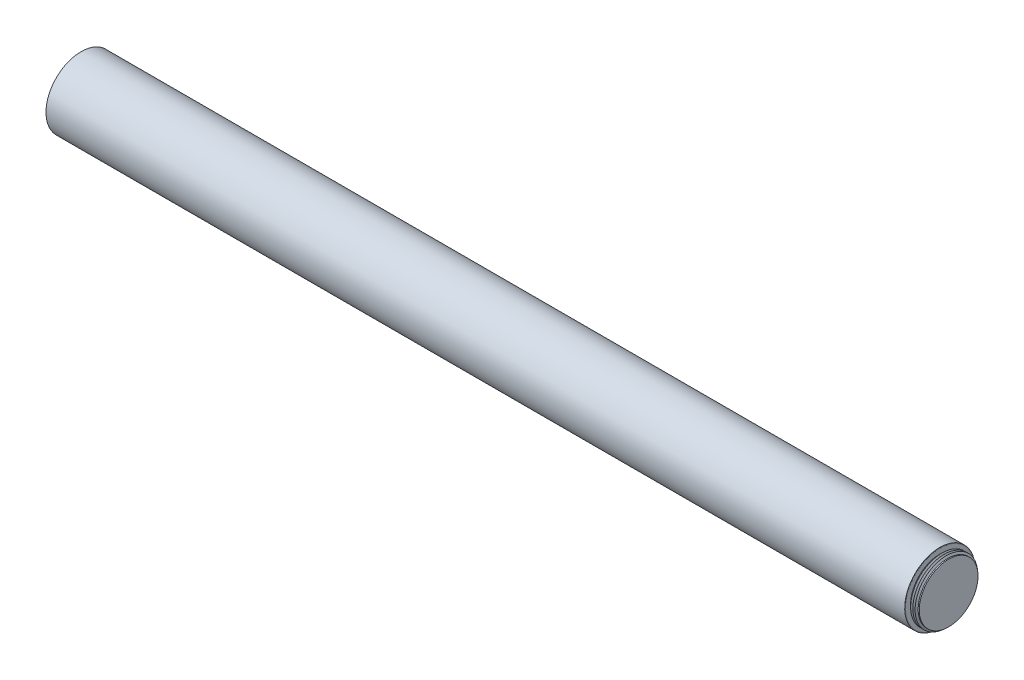
ISO-10303-21;
HEADER;
FILE_DESCRIPTION(('STEP AP214'),'2;1');
FILE_NAME('part.step','',(''),(''),'','','');
FILE_SCHEMA(('AUTOMOTIVE_DESIGN { 1 0 10303 214 1 1 1 1 }'));
ENDSEC;
DATA;
#1=APPLICATION_CONTEXT('core data for automotive mechanical design processes');
#2=APPLICATION_PROTOCOL_DEFINITION('international standard','automotive_design',2000,#1);
#3=PRODUCT_CONTEXT('',#1,'mechanical');
#4=PRODUCT('Part','Part','',(#3));
#5=PRODUCT_RELATED_PRODUCT_CATEGORY('part','',(#4));
#6=PRODUCT_DEFINITION_FORMATION('','',#4);
#7=PRODUCT_DEFINITION_CONTEXT('part definition',#1,'design');
#8=PRODUCT_DEFINITION('design','',#6,#7);
#9=PRODUCT_DEFINITION_SHAPE('','',#8);
#10=(LENGTH_UNIT() NAMED_UNIT(*) SI_UNIT(.MILLI.,.METRE.));
#11=(NAMED_UNIT(*) PLANE_ANGLE_UNIT() SI_UNIT($,.RADIAN.));
#12=(NAMED_UNIT(*) SI_UNIT($,.STERADIAN.) SOLID_ANGLE_UNIT());
#13=UNCERTAINTY_MEASURE_WITH_UNIT(LENGTH_MEASURE(1.E-05),#10,'distance_accuracy_value','');
#14=(GEOMETRIC_REPRESENTATION_CONTEXT(3) GLOBAL_UNCERTAINTY_ASSIGNED_CONTEXT((#13)) GLOBAL_UNIT_ASSIGNED_CONTEXT((#10,
#11,#12)) REPRESENTATION_CONTEXT('',''));
#15=CARTESIAN_POINT('',(0.,0.,0.));
#16=DIRECTION('',(0.,0.,1.));
#17=DIRECTION('',(1.,0.,0.));
#18=AXIS2_PLACEMENT_3D('',#15,#16,#17);
#19=CARTESIAN_POINT('',(-101.282037882412,-112.40761589404,6.95959679333066E-13));
#20=DIRECTION('',(1.,0.,0.));
#21=DIRECTION('',(0.,0.203317589338989,0.979112842253324));
#22=AXIS2_PLACEMENT_3D('',#19,#20,#21);
#23=PLANE('',#22);
#24=CARTESIAN_POINT('',(-101.282037882412,-112.40761589404,6.95959679333066E-13));
#25=DIRECTION('',(1.,0.,0.));
#26=DIRECTION('',(0.,0.203317589338989,0.979112842253324));
#27=AXIS2_PLACEMENT_3D('',#24,#25,#26);
#28=CIRCLE('',#27,49.784);
#29=CARTESIAN_POINT('',(-101.282037882411,-102.285653026388,48.7441537387402));
#30=VERTEX_POINT('',#29);
#31=EDGE_CURVE('E67',#30,#30,#28,.T.);
#32=ORIENTED_EDGE('',*,*,#31,.T.);
#33=EDGE_LOOP('',(#32));
#34=FACE_BOUND('',#33,.T.);
#35=CARTESIAN_POINT('',(-101.282037882412,-112.40761589404,8.14057642514373E-13));
#36=DIRECTION('',(1.,0.,0.));
#37=DIRECTION('',(0.,0.,-1.));
#38=AXIS2_PLACEMENT_3D('',#35,#36,#37);
#39=CIRCLE('',#38,48.8237923991093);
#40=CARTESIAN_POINT('',(-101.282037882412,-112.40761589404,-48.8237923991085));
#41=VERTEX_POINT('',#40);
#42=EDGE_CURVE('E18',#41,#41,#39,.T.);
#43=ORIENTED_EDGE('',*,*,#42,.F.);
#44=EDGE_LOOP('',(#43));
#45=FACE_BOUND('',#44,.T.);
#46=ADVANCED_FACE('F14',(#34,#45),#23,.T.);
#47=CARTESIAN_POINT('',(-1320.73603788241,-112.40761589404,1.97906001602816E-12));
#48=DIRECTION('',(1.,0.,0.));
#49=DIRECTION('',(0.,0.203317589338989,0.979112842253324));
#50=AXIS2_PLACEMENT_3D('',#47,#48,#49);
#51=PLANE('',#50);
#52=CARTESIAN_POINT('',(-1320.73603788241,-112.40761589404,1.97906001602816E-12));
#53=DIRECTION('',(1.,0.,0.));
#54=DIRECTION('',(0.,0.203317589338989,0.979112842253324));
#55=AXIS2_PLACEMENT_3D('',#52,#53,#54);
#56=CIRCLE('',#55,49.784);
#57=CARTESIAN_POINT('',(-1320.73603788241,-102.285653026388,48.7441537387414));
#58=VERTEX_POINT('',#57);
#59=EDGE_CURVE('E68',#58,#58,#56,.T.);
#60=ORIENTED_EDGE('',*,*,#59,.F.);
#61=EDGE_LOOP('',(#60));
#62=FACE_BOUND('',#61,.T.);
#63=CARTESIAN_POINT('',(-1320.73603788241,-112.40761589404,1.98736084132082E-12));
#64=DIRECTION('',(1.,0.,0.));
#65=DIRECTION('',(0.,0.,-1.));
#66=AXIS2_PLACEMENT_3D('',#63,#64,#65);
#67=CIRCLE('',#66,48.9203999999995);
#68=CARTESIAN_POINT('',(-1320.73603788241,-112.40761589404,-48.9203999999975));
#69=VERTEX_POINT('',#68);
#70=EDGE_CURVE('E64',#69,#69,#67,.F.);
#71=ORIENTED_EDGE('',*,*,#70,.F.);
#72=EDGE_LOOP('',(#71));
#73=FACE_BOUND('',#72,.T.);
#74=ADVANCED_FACE('F276',(#62,#73),#51,.F.);
#75=CARTESIAN_POINT('',(-101.282037882412,-112.40761589404,6.95959679333066E-13));
#76=DIRECTION('',(-1.,0.,0.));
#77=DIRECTION('',(0.,-0.203317589338989,-0.979112842253324));
#78=AXIS2_PLACEMENT_3D('',#75,#76,#77);
#79=CYLINDRICAL_SURFACE('',#78,49.784);
#80=ORIENTED_EDGE('',*,*,#31,.F.);
#81=EDGE_LOOP('',(#80));
#82=FACE_BOUND('',#81,.T.);
#83=ORIENTED_EDGE('',*,*,#59,.T.);
#84=EDGE_LOOP('',(#83));
#85=FACE_BOUND('',#84,.T.);
#86=ADVANCED_FACE('F283',(#82,#85),#79,.T.);
#87=CARTESIAN_POINT('',(-1320.73603788241,-112.40761589404,1.98045789837065E-12));
#88=DIRECTION('',(1.,0.,0.));
#89=DIRECTION('',(0.,0.999990910254518,-0.00426373173999859));
#90=AXIS2_PLACEMENT_3D('',#87,#88,#89);
#91=CIRCLE('',#90,44.45);
#92=CARTESIAN_POINT('',(-1320.73603788241,-67.9580199332265,-0.189522875840957));
#93=VERTEX_POINT('',#92);
#94=EDGE_CURVE('E155',#93,#93,#91,.T.);
#95=ORIENTED_EDGE('',*,*,#94,.T.);
#96=EDGE_LOOP('',(#95));
#97=FACE_BOUND('',#96,.T.);
#98=ORIENTED_EDGE('',*,*,#70,.T.);
#99=EDGE_LOOP('',(#98));
#100=FACE_BOUND('',#99,.T.);
#101=ADVANCED_FACE('F163',(#97,#100),#51,.F.);
#102=CARTESIAN_POINT('',(-101.114708609272,-112.40761589404,7.84938641112028E-13));
#103=DIRECTION('',(1.,0.,0.));
#104=DIRECTION('',(0.,0.,-1.));
#105=AXIS2_PLACEMENT_3D('',#102,#103,#104);
#106=CONICAL_SURFACE('',#105,48.9204,0.523598775598301);
#107=ORIENTED_EDGE('',*,*,#42,.T.);
#108=EDGE_LOOP('',(#107));
#109=FACE_BOUND('',#108,.T.);
#110=CARTESIAN_POINT('',(-101.114708609272,-112.40761589404,7.84938641112028E-13));
#111=DIRECTION('',(-1.,0.,0.));
#112=DIRECTION('',(0.,0.,1.));
#113=AXIS2_PLACEMENT_3D('',#110,#111,#112);
#114=CIRCLE('',#113,48.9204);
#115=CARTESIAN_POINT('',(-101.114708609272,-112.40761589404,48.9204000000008));
#116=VERTEX_POINT('',#115);
#117=EDGE_CURVE('E10',#116,#116,#114,.T.);
#118=ORIENTED_EDGE('',*,*,#117,.T.);
#119=EDGE_LOOP('',(#118));
#120=FACE_BOUND('',#119,.T.);
#121=ADVANCED_FACE('F16',(#109,#120),#106,.T.);
#122=CARTESIAN_POINT('',(-101.114708609272,-63.4872158940397,7.84938641112028E-13));
#123=DIRECTION('',(-1.,0.,0.));
#124=DIRECTION('',(0.,0.,1.));
#125=AXIS2_PLACEMENT_3D('',#122,#123,#124);
#126=PLANE('',#125);
#127=ORIENTED_EDGE('',*,*,#117,.F.);
#128=EDGE_LOOP('',(#127));
#129=FACE_BOUND('',#128,.T.);
#130=CARTESIAN_POINT('',(-101.114708609271,-112.40761589404,7.84938641112028E-13));
#131=DIRECTION('',(1.,0.,0.));
#132=DIRECTION('',(0.,0.,-1.));
#133=AXIS2_PLACEMENT_3D('',#130,#131,#132);
#134=CIRCLE('',#133,41.70035475);
#135=CARTESIAN_POINT('',(-101.114708609271,-112.40761589404,-41.7003547499992));
#136=VERTEX_POINT('',#135);
#137=EDGE_CURVE('E23',#136,#136,#134,.T.);
#138=ORIENTED_EDGE('',*,*,#137,.F.);
#139=EDGE_LOOP('',(#138));
#140=FACE_BOUND('',#139,.T.);
#141=ADVANCED_FACE('F329',(#129,#140),#126,.F.);
#142=CARTESIAN_POINT('',(-88.6687086092715,-67.9576158940398,7.84938641112028E-13));
#143=DIRECTION('',(-1.,0.,0.));
#144=DIRECTION('',(0.,0.,1.));
#145=AXIS2_PLACEMENT_3D('',#142,#143,#144);
#146=PLANE('',#145);
#147=CARTESIAN_POINT('',(-88.6687086092715,-112.40761589404,7.84938641112028E-13));
#148=DIRECTION('',(1.,0.,0.));
#149=DIRECTION('',(0.,0.,-1.));
#150=AXIS2_PLACEMENT_3D('',#147,#148,#149);
#151=CIRCLE('',#150,41.70035475);
#152=CARTESIAN_POINT('',(-88.6687086092715,-112.40761589404,-41.7003547499992));
#153=VERTEX_POINT('',#152);
#154=EDGE_CURVE('E60',#153,#153,#151,.T.);
#155=ORIENTED_EDGE('',*,*,#154,.T.);
#156=EDGE_LOOP('',(#155));
#157=FACE_BOUND('',#156,.T.);
#158=ADVANCED_FACE('F326',(#157),#146,.F.);
#159=CARTESIAN_POINT('',(-88.6687086092715,-112.40761589404,7.84938641112028E-13));
#160=DIRECTION('',(1.,0.,0.));
#161=DIRECTION('',(0.,0.,-1.));
#162=AXIS2_PLACEMENT_3D('',#159,#160,#161);
#163=CYLINDRICAL_SURFACE('',#162,41.70035475);
#164=CARTESIAN_POINT('',(-99.7812591608523,-112.40761589404,7.84938641112028E-13));
#165=DIRECTION('',(1.,0.,0.));
#166=DIRECTION('',(0.,0.,-1.));
#167=AXIS2_PLACEMENT_3D('',#164,#165,#166);
#168=CIRCLE('',#167,41.70035475);
#169=CARTESIAN_POINT('',(-99.7812591608523,-112.40761589404,-41.7003547499992));
#170=VERTEX_POINT('',#169);
#171=EDGE_CURVE('E30',#170,#170,#168,.T.);
#172=ORIENTED_EDGE('',*,*,#171,.F.);
#173=EDGE_LOOP('',(#172));
#174=FACE_BOUND('',#173,.T.);
#175=ORIENTED_EDGE('',*,*,#137,.T.);
#176=EDGE_LOOP('',(#175));
#177=FACE_BOUND('',#176,.T.);
#178=ADVANCED_FACE('F322',(#174,#177),#163,.T.);
#179=CARTESIAN_POINT('',(-99.7812591608523,-112.40761589404,7.84938641112028E-13));
#180=DIRECTION('',(1.,0.,0.));
#181=DIRECTION('',(0.,0.,-1.));
#182=AXIS2_PLACEMENT_3D('',#179,#180,#181);
#183=CONICAL_SURFACE('',#182,41.70035475,1.0471975511966);
#184=CARTESIAN_POINT('',(-98.1937507355888,-112.40761589404,7.84938641112028E-13));
#185=DIRECTION('',(1.,0.,0.));
#186=DIRECTION('',(0.,0.,-1.));
#187=AXIS2_PLACEMENT_3D('',#184,#185,#186);
#188=CIRCLE('',#187,44.45);
#189=CARTESIAN_POINT('',(-98.1937507355888,-112.40761589404,-44.4499999999992));
#190=VERTEX_POINT('',#189);
#191=EDGE_CURVE('E36',#190,#190,#188,.T.);
#192=ORIENTED_EDGE('',*,*,#191,.F.);
#193=EDGE_LOOP('',(#192));
#194=FACE_BOUND('',#193,.T.);
#195=ORIENTED_EDGE('',*,*,#171,.T.);
#196=EDGE_LOOP('',(#195));
#197=FACE_BOUND('',#196,.T.);
#198=ADVANCED_FACE('F318',(#194,#197),#183,.T.);
#199=CARTESIAN_POINT('',(-98.1937507355888,-112.40761589404,7.84938641112028E-13));
#200=DIRECTION('',(-1.,0.,0.));
#201=DIRECTION('',(0.,0.,1.));
#202=AXIS2_PLACEMENT_3D('',#199,#200,#201);
#203=CONICAL_SURFACE('',#202,44.45,1.0471975511966);
#204=CARTESIAN_POINT('',(-96.6062423103254,-112.40761589404,7.84938641112028E-13));
#205=DIRECTION('',(1.,0.,0.));
#206=DIRECTION('',(0.,0.,-1.));
#207=AXIS2_PLACEMENT_3D('',#204,#205,#206);
#208=CIRCLE('',#207,41.70035475);
#209=CARTESIAN_POINT('',(-96.6062423103254,-112.40761589404,-41.7003547499992));
#210=VERTEX_POINT('',#209);
#211=EDGE_CURVE('E40',#210,#210,#208,.T.);
#212=ORIENTED_EDGE('',*,*,#211,.F.);
#213=EDGE_LOOP('',(#212));
#214=FACE_BOUND('',#213,.T.);
#215=ORIENTED_EDGE('',*,*,#191,.T.);
#216=EDGE_LOOP('',(#215));
#217=FACE_BOUND('',#216,.T.);
#218=ADVANCED_FACE('F314',(#214,#217),#203,.T.);
#219=CARTESIAN_POINT('',(-96.6062423103254,-112.40761589404,7.84938641112028E-13));
#220=DIRECTION('',(1.,0.,0.));
#221=DIRECTION('',(0.,0.,-1.));
#222=AXIS2_PLACEMENT_3D('',#219,#220,#221);
#223=CONICAL_SURFACE('',#222,41.70035475,1.0471975511966);
#224=CARTESIAN_POINT('',(-95.0187338850619,-112.40761589404,7.84938641112028E-13));
#225=DIRECTION('',(1.,0.,0.));
#226=DIRECTION('',(0.,0.,-1.));
#227=AXIS2_PLACEMENT_3D('',#224,#225,#226);
#228=CIRCLE('',#227,44.45);
#229=CARTESIAN_POINT('',(-95.0187338850619,-112.40761589404,-44.4499999999992));
#230=VERTEX_POINT('',#229);
#231=EDGE_CURVE('E44',#230,#230,#228,.T.);
#232=ORIENTED_EDGE('',*,*,#231,.F.);
#233=EDGE_LOOP('',(#232));
#234=FACE_BOUND('',#233,.T.);
#235=ORIENTED_EDGE('',*,*,#211,.T.);
#236=EDGE_LOOP('',(#235));
#237=FACE_BOUND('',#236,.T.);
#238=ADVANCED_FACE('F310',(#234,#237),#223,.T.);
#239=CARTESIAN_POINT('',(-95.0187338850619,-112.40761589404,7.84938641112028E-13));
#240=DIRECTION('',(-1.,0.,0.));
#241=DIRECTION('',(0.,0.,1.));
#242=AXIS2_PLACEMENT_3D('',#239,#240,#241);
#243=CONICAL_SURFACE('',#242,44.45,1.0471975511966);
#244=CARTESIAN_POINT('',(-93.4312254597984,-112.40761589404,7.84938641112028E-13));
#245=DIRECTION('',(1.,0.,0.));
#246=DIRECTION('',(0.,0.,-1.));
#247=AXIS2_PLACEMENT_3D('',#244,#245,#246);
#248=CIRCLE('',#247,41.70035475);
#249=CARTESIAN_POINT('',(-93.4312254597984,-112.40761589404,-41.7003547499992));
#250=VERTEX_POINT('',#249);
#251=EDGE_CURVE('E48',#250,#250,#248,.T.);
#252=ORIENTED_EDGE('',*,*,#251,.F.);
#253=EDGE_LOOP('',(#252));
#254=FACE_BOUND('',#253,.T.);
#255=ORIENTED_EDGE('',*,*,#231,.T.);
#256=EDGE_LOOP('',(#255));
#257=FACE_BOUND('',#256,.T.);
#258=ADVANCED_FACE('F306',(#254,#257),#243,.T.);
#259=CARTESIAN_POINT('',(-93.4312254597984,-112.40761589404,7.84938641112028E-13));
#260=DIRECTION('',(1.,0.,0.));
#261=DIRECTION('',(0.,0.,-1.));
#262=AXIS2_PLACEMENT_3D('',#259,#260,#261);
#263=CONICAL_SURFACE('',#262,41.70035475,1.0471975511966);
#264=CARTESIAN_POINT('',(-91.843717034535,-112.40761589404,7.84938641112028E-13));
#265=DIRECTION('',(1.,0.,0.));
#266=DIRECTION('',(0.,0.,-1.));
#267=AXIS2_PLACEMENT_3D('',#264,#265,#266);
#268=CIRCLE('',#267,44.45);
#269=CARTESIAN_POINT('',(-91.843717034535,-112.40761589404,-44.4499999999992));
#270=VERTEX_POINT('',#269);
#271=EDGE_CURVE('E52',#270,#270,#268,.T.);
#272=ORIENTED_EDGE('',*,*,#271,.F.);
#273=EDGE_LOOP('',(#272));
#274=FACE_BOUND('',#273,.T.);
#275=ORIENTED_EDGE('',*,*,#251,.T.);
#276=EDGE_LOOP('',(#275));
#277=FACE_BOUND('',#276,.T.);
#278=ADVANCED_FACE('F302',(#274,#277),#263,.T.);
#279=CARTESIAN_POINT('',(-91.843717034535,-112.40761589404,7.84938641112028E-13));
#280=DIRECTION('',(-1.,0.,0.));
#281=DIRECTION('',(0.,0.,1.));
#282=AXIS2_PLACEMENT_3D('',#279,#280,#281);
#283=CONICAL_SURFACE('',#282,44.45,1.04719755119659);
#284=CARTESIAN_POINT('',(-90.2562086092715,-112.40761589404,7.84938641112028E-13));
#285=DIRECTION('',(1.,0.,0.));
#286=DIRECTION('',(0.,0.,-1.));
#287=AXIS2_PLACEMENT_3D('',#284,#285,#286);
#288=CIRCLE('',#287,41.70035475);
#289=CARTESIAN_POINT('',(-90.2562086092715,-112.40761589404,-41.7003547499992));
#290=VERTEX_POINT('',#289);
#291=EDGE_CURVE('E56',#290,#290,#288,.T.);
#292=ORIENTED_EDGE('',*,*,#291,.F.);
#293=EDGE_LOOP('',(#292));
#294=FACE_BOUND('',#293,.T.);
#295=ORIENTED_EDGE('',*,*,#271,.T.);
#296=EDGE_LOOP('',(#295));
#297=FACE_BOUND('',#296,.T.);
#298=ADVANCED_FACE('F298',(#294,#297),#283,.T.);
#299=CARTESIAN_POINT('',(-88.6687086092715,-112.40761589404,7.84938641112028E-13));
#300=DIRECTION('',(1.,0.,0.));
#301=DIRECTION('',(0.,0.,-1.));
#302=AXIS2_PLACEMENT_3D('',#299,#300,#301);
#303=CYLINDRICAL_SURFACE('',#302,41.70035475);
#304=ORIENTED_EDGE('',*,*,#154,.F.);
#305=EDGE_LOOP('',(#304));
#306=FACE_BOUND('',#305,.T.);
#307=ORIENTED_EDGE('',*,*,#291,.T.);
#308=EDGE_LOOP('',(#307));
#309=FACE_BOUND('',#308,.T.);
#310=ADVANCED_FACE('F295',(#306,#309),#303,.T.);
#311=CARTESIAN_POINT('',(-1276.03203788241,-112.40761589404,1.78264800939103E-12));
#312=DIRECTION('',(-1.,0.,0.));
#313=DIRECTION('',(0.,0.,1.));
#314=AXIS2_PLACEMENT_3D('',#311,#312,#313);
#315=PLANE('',#314);
#316=CARTESIAN_POINT('',(-1276.03203788241,-112.40761589404,1.78264800939103E-12));
#317=DIRECTION('',(-1.,0.,0.));
#318=DIRECTION('',(0.,-0.999990910254518,0.00426373173999859));
#319=AXIS2_PLACEMENT_3D('',#316,#317,#318);
#320=CIRCLE('',#319,36.449);
#321=CARTESIAN_POINT('',(-1276.03203788241,-148.856284581907,0.155408758192991));
#322=VERTEX_POINT('',#321);
#323=EDGE_CURVE('E151',#322,#322,#320,.T.);
#324=ORIENTED_EDGE('',*,*,#323,.T.);
#325=EDGE_LOOP('',(#324));
#326=FACE_BOUND('',#325,.T.);
#327=ADVANCED_FACE('F288',(#326),#315,.T.);
#328=CARTESIAN_POINT('',(-1277.55603788241,-112.40761589404,1.85339397344328E-12));
#329=DIRECTION('',(1.,0.,0.));
#330=DIRECTION('',(0.,0.999990910254518,-0.00426373173999859));
#331=AXIS2_PLACEMENT_3D('',#328,#329,#330);
#332=CONICAL_SURFACE('',#331,34.925,0.785398163397451);
#333=ORIENTED_EDGE('',*,*,#323,.F.);
#334=EDGE_LOOP('',(#333));
#335=FACE_BOUND('',#334,.T.);
#336=CARTESIAN_POINT('',(-1277.55603788241,-112.40761589404,1.85339397344328E-12));
#337=DIRECTION('',(-1.,0.,0.));
#338=DIRECTION('',(0.,-0.999990910254518,0.00426373173999859));
#339=AXIS2_PLACEMENT_3D('',#336,#337,#338);
#340=CIRCLE('',#339,34.925);
#341=CARTESIAN_POINT('',(-1277.55603788241,-147.332298434679,0.148910831021304));
#342=VERTEX_POINT('',#341);
#343=EDGE_CURVE('E143',#342,#342,#340,.F.);
#344=ORIENTED_EDGE('',*,*,#343,.F.);
#345=EDGE_LOOP('',(#344));
#346=FACE_BOUND('',#345,.T.);
#347=ADVANCED_FACE('F170',(#335,#346),#332,.F.);
#348=CARTESIAN_POINT('',(-1320.73603788241,-112.40761589404,1.98045789837065E-12));
#349=DIRECTION('',(1.,0.,0.));
#350=DIRECTION('',(0.,0.999990910254518,-0.00426373173999859));
#351=AXIS2_PLACEMENT_3D('',#348,#349,#350);
#352=CYLINDRICAL_SURFACE('',#351,44.45);
#353=ORIENTED_EDGE('',*,*,#94,.F.);
#354=EDGE_LOOP('',(#353));
#355=FACE_BOUND('',#354,.T.);
#356=CARTESIAN_POINT('',(-1318.95803788241,-112.40761589404,1.9787493151274E-12));
#357=DIRECTION('',(1.,0.,0.));
#358=DIRECTION('',(0.,0.999990910254518,-0.00426373173999859));
#359=AXIS2_PLACEMENT_3D('',#356,#357,#358);
#360=CIRCLE('',#359,44.45);
#361=CARTESIAN_POINT('',(-1318.95803788241,-67.9580199332265,-0.189522875840959));
#362=VERTEX_POINT('',#361);
#363=EDGE_CURVE('E72',#362,#362,#360,.T.);
#364=ORIENTED_EDGE('',*,*,#363,.T.);
#365=EDGE_LOOP('',(#364));
#366=FACE_BOUND('',#365,.T.);
#367=ADVANCED_FACE('F166',(#355,#366),#352,.F.);
#368=CARTESIAN_POINT('',(-1317.37052945715,-112.40761589404,1.97763423154013E-12));
#369=DIRECTION('',(-1.,0.,0.));
#370=DIRECTION('',(0.,-0.999990910254518,0.00426373173999859));
#371=AXIS2_PLACEMENT_3D('',#368,#369,#370);
#372=CONICAL_SURFACE('',#371,41.70035475,1.0471975511966);
#373=ORIENTED_EDGE('',*,*,#363,.F.);
#374=EDGE_LOOP('',(#373));
#375=FACE_BOUND('',#374,.T.);
#376=CARTESIAN_POINT('',(-1317.37052945715,-112.40761589404,1.97763423154013E-12));
#377=DIRECTION('',(1.,0.,0.));
#378=DIRECTION('',(0.,0.999990910254518,-0.00426373173999859));
#379=AXIS2_PLACEMENT_3D('',#376,#377,#378);
#380=CIRCLE('',#379,41.70035475);
#381=CARTESIAN_POINT('',(-1317.37052945715,-70.707640189651,-0.177799126114798));
#382=VERTEX_POINT('',#381);
#383=EDGE_CURVE('E79',#382,#382,#380,.T.);
#384=ORIENTED_EDGE('',*,*,#383,.T.);
#385=EDGE_LOOP('',(#384));
#386=FACE_BOUND('',#385,.T.);
#387=ADVANCED_FACE('F169',(#375,#386),#372,.F.);
#388=CARTESIAN_POINT('',(-1315.78302103189,-112.40761589404,1.97608547102591E-12));
#389=DIRECTION('',(1.,0.,0.));
#390=DIRECTION('',(0.,0.999990910254518,-0.00426373173999859));
#391=AXIS2_PLACEMENT_3D('',#388,#389,#390);
#392=CONICAL_SURFACE('',#391,44.45,1.04719755119659);
#393=ORIENTED_EDGE('',*,*,#383,.F.);
#394=EDGE_LOOP('',(#393));
#395=FACE_BOUND('',#394,.T.);
#396=CARTESIAN_POINT('',(-1315.78302103189,-112.40761589404,1.97608547102591E-12));
#397=DIRECTION('',(1.,0.,0.));
#398=DIRECTION('',(0.,0.999990910254518,-0.00426373173999859));
#399=AXIS2_PLACEMENT_3D('',#396,#397,#398);
#400=CIRCLE('',#399,44.45);
#401=CARTESIAN_POINT('',(-1315.78302103189,-67.9580199332265,-0.189522875840961));
#402=VERTEX_POINT('',#401);
#403=EDGE_CURVE('E83',#402,#402,#400,.T.);
#404=ORIENTED_EDGE('',*,*,#403,.T.);
#405=EDGE_LOOP('',(#404));
#406=FACE_BOUND('',#405,.T.);
#407=ADVANCED_FACE('F176',(#395,#406),#392,.F.);
#408=CARTESIAN_POINT('',(-1314.19551681924,-112.40761589404,1.97475355250955E-12));
#409=DIRECTION('',(-1.,0.,0.));
#410=DIRECTION('',(0.,-0.999990910254518,0.00426373173999859));
#411=AXIS2_PLACEMENT_3D('',#408,#409,#410);
#412=CONICAL_SURFACE('',#411,41.7003620464632,1.0471975511966);
#413=ORIENTED_EDGE('',*,*,#403,.F.);
#414=EDGE_LOOP('',(#413));
#415=FACE_BOUND('',#414,.T.);
#416=CARTESIAN_POINT('',(-1314.19551681924,-112.40761589404,1.97475355250955E-12));
#417=DIRECTION('',(1.,0.,0.));
#418=DIRECTION('',(0.,0.999990910254518,-0.00426373173999859));
#419=AXIS2_PLACEMENT_3D('',#416,#417,#418);
#420=CIRCLE('',#419,41.7003620464632);
#421=CARTESIAN_POINT('',(-1314.19551681924,-70.7076328932542,-0.177799157224963));
#422=VERTEX_POINT('',#421);
#423=EDGE_CURVE('E87',#422,#422,#420,.T.);
#424=ORIENTED_EDGE('',*,*,#423,.T.);
#425=EDGE_LOOP('',(#424));
#426=FACE_BOUND('',#425,.T.);
#427=ADVANCED_FACE('F182',(#415,#426),#412,.F.);
#428=CARTESIAN_POINT('',(-1312.60800839397,-112.40761589404,1.9734216304588E-12));
#429=DIRECTION('',(1.,0.,0.));
#430=DIRECTION('',(0.,0.999990910254518,-0.00426373173999859));
#431=AXIS2_PLACEMENT_3D('',#428,#429,#430);
#432=CONICAL_SURFACE('',#431,44.4500072964631,1.04719755119659);
#433=ORIENTED_EDGE('',*,*,#423,.F.);
#434=EDGE_LOOP('',(#433));
#435=FACE_BOUND('',#434,.T.);
#436=CARTESIAN_POINT('',(-1312.60800839397,-112.40761589404,1.9734216304588E-12));
#437=DIRECTION('',(1.,0.,0.));
#438=DIRECTION('',(0.,0.999990910254518,-0.00426373173999859));
#439=AXIS2_PLACEMENT_3D('',#436,#437,#438);
#440=CIRCLE('',#439,44.4500072964631);
#441=CARTESIAN_POINT('',(-1312.60800839397,-67.9580126368297,-0.189522906951126));
#442=VERTEX_POINT('',#441);
#443=EDGE_CURVE('E91',#442,#442,#440,.T.);
#444=ORIENTED_EDGE('',*,*,#443,.T.);
#445=EDGE_LOOP('',(#444));
#446=FACE_BOUND('',#445,.T.);
#447=ADVANCED_FACE('F188',(#435,#446),#432,.F.);
#448=CARTESIAN_POINT('',(-1311.02050418132,-112.40761589404,1.97208971194244E-12));
#449=DIRECTION('',(-1.,0.,0.));
#450=DIRECTION('',(0.,-0.999990910254518,0.00426373173999859));
#451=AXIS2_PLACEMENT_3D('',#448,#449,#450);
#452=CONICAL_SURFACE('',#451,41.7003693429263,1.0471975511966);
#453=ORIENTED_EDGE('',*,*,#443,.F.);
#454=EDGE_LOOP('',(#453));
#455=FACE_BOUND('',#454,.T.);
#456=CARTESIAN_POINT('',(-1311.02050418132,-112.40761589404,1.97208971194244E-12));
#457=DIRECTION('',(1.,0.,0.));
#458=DIRECTION('',(0.,0.999990910254518,-0.00426373173999859));
#459=AXIS2_PLACEMENT_3D('',#456,#457,#458);
#460=CIRCLE('',#459,41.7003693429263);
#461=CARTESIAN_POINT('',(-1311.02050418132,-70.7076255968573,-0.177799188335127));
#462=VERTEX_POINT('',#461);
#463=EDGE_CURVE('E95',#462,#462,#460,.T.);
#464=ORIENTED_EDGE('',*,*,#463,.T.);
#465=EDGE_LOOP('',(#464));
#466=FACE_BOUND('',#465,.T.);
#467=ADVANCED_FACE('F194',(#455,#466),#452,.F.);
#468=CARTESIAN_POINT('',(-1309.43299575606,-112.40761589404,1.9707577898917E-12));
#469=DIRECTION('',(1.,0.,0.));
#470=DIRECTION('',(0.,0.999990910254518,-0.00426373173999859));
#471=AXIS2_PLACEMENT_3D('',#468,#469,#470);
#472=CONICAL_SURFACE('',#471,44.4500145929263,1.04719755119659);
#473=ORIENTED_EDGE('',*,*,#463,.F.);
#474=EDGE_LOOP('',(#473));
#475=FACE_BOUND('',#474,.T.);
#476=CARTESIAN_POINT('',(-1309.43299575606,-112.40761589404,1.9707577898917E-12));
#477=DIRECTION('',(1.,0.,0.));
#478=DIRECTION('',(0.,0.999990910254518,-0.00426373173999859));
#479=AXIS2_PLACEMENT_3D('',#476,#477,#478);
#480=CIRCLE('',#479,44.4500145929263);
#481=CARTESIAN_POINT('',(-1309.43299575606,-67.9580053404328,-0.18952293806129));
#482=VERTEX_POINT('',#481);
#483=EDGE_CURVE('E99',#482,#482,#480,.T.);
#484=ORIENTED_EDGE('',*,*,#483,.T.);
#485=EDGE_LOOP('',(#484));
#486=FACE_BOUND('',#485,.T.);
#487=ADVANCED_FACE('F200',(#475,#486),#472,.F.);
#488=CARTESIAN_POINT('',(-1307.84549154341,-112.40761589404,1.96942587137534E-12));
#489=DIRECTION('',(-1.,0.,0.));
#490=DIRECTION('',(0.,-0.999990910254518,0.00426373173999859));
#491=AXIS2_PLACEMENT_3D('',#488,#489,#490);
#492=CONICAL_SURFACE('',#491,41.7003766393895,1.0471975511966);
#493=ORIENTED_EDGE('',*,*,#483,.F.);
#494=EDGE_LOOP('',(#493));
#495=FACE_BOUND('',#494,.T.);
#496=CARTESIAN_POINT('',(-1307.84549154341,-112.40761589404,1.96942587137534E-12));
#497=DIRECTION('',(1.,0.,0.));
#498=DIRECTION('',(0.,0.999990910254518,-0.00426373173999859));
#499=AXIS2_PLACEMENT_3D('',#496,#497,#498);
#500=CIRCLE('',#499,41.7003766393895);
#501=CARTESIAN_POINT('',(-1307.84549154341,-70.7076183004605,-0.177799219445291));
#502=VERTEX_POINT('',#501);
#503=EDGE_CURVE('E103',#502,#502,#500,.T.);
#504=ORIENTED_EDGE('',*,*,#503,.T.);
#505=EDGE_LOOP('',(#504));
#506=FACE_BOUND('',#505,.T.);
#507=ADVANCED_FACE('F206',(#495,#506),#492,.F.);
#508=CARTESIAN_POINT('',(-1306.25798311815,-112.40761589404,1.96809394932459E-12));
#509=DIRECTION('',(1.,0.,0.));
#510=DIRECTION('',(0.,0.999990910254518,-0.00426373173999859));
#511=AXIS2_PLACEMENT_3D('',#508,#509,#510);
#512=CONICAL_SURFACE('',#511,44.4500218893895,1.04719755119659);
#513=ORIENTED_EDGE('',*,*,#503,.F.);
#514=EDGE_LOOP('',(#513));
#515=FACE_BOUND('',#514,.T.);
#516=CARTESIAN_POINT('',(-1306.25798311815,-112.40761589404,1.96809394932459E-12));
#517=DIRECTION('',(1.,0.,0.));
#518=DIRECTION('',(0.,0.999990910254518,-0.00426373173999859));
#519=AXIS2_PLACEMENT_3D('',#516,#517,#518);
#520=CIRCLE('',#519,44.4500218893895);
#521=CARTESIAN_POINT('',(-1306.25798311815,-67.957998044036,-0.189522969171454));
#522=VERTEX_POINT('',#521);
#523=EDGE_CURVE('E107',#522,#522,#520,.T.);
#524=ORIENTED_EDGE('',*,*,#523,.T.);
#525=EDGE_LOOP('',(#524));
#526=FACE_BOUND('',#525,.T.);
#527=ADVANCED_FACE('F212',(#515,#526),#512,.F.);
#528=CARTESIAN_POINT('',(-1304.6704789055,-112.40761589404,1.96676203080823E-12));
#529=DIRECTION('',(-1.,0.,0.));
#530=DIRECTION('',(0.,-0.999990910254518,0.00426373173999859));
#531=AXIS2_PLACEMENT_3D('',#528,#529,#530);
#532=CONICAL_SURFACE('',#531,41.7003839358526,1.0471975511966);
#533=ORIENTED_EDGE('',*,*,#523,.F.);
#534=EDGE_LOOP('',(#533));
#535=FACE_BOUND('',#534,.T.);
#536=CARTESIAN_POINT('',(-1304.6704789055,-112.40761589404,1.96676203080823E-12));
#537=DIRECTION('',(1.,0.,0.));
#538=DIRECTION('',(0.,0.999990910254518,-0.00426373173999859));
#539=AXIS2_PLACEMENT_3D('',#536,#537,#538);
#540=CIRCLE('',#539,41.7003839358526);
#541=CARTESIAN_POINT('',(-1304.6704789055,-70.7076110040637,-0.177799250555456));
#542=VERTEX_POINT('',#541);
#543=EDGE_CURVE('E111',#542,#542,#540,.T.);
#544=ORIENTED_EDGE('',*,*,#543,.T.);
#545=EDGE_LOOP('',(#544));
#546=FACE_BOUND('',#545,.T.);
#547=ADVANCED_FACE('F218',(#535,#546),#532,.F.);
#548=CARTESIAN_POINT('',(-1303.08297048024,-112.40761589404,1.96543010875748E-12));
#549=DIRECTION('',(1.,0.,0.));
#550=DIRECTION('',(0.,0.999990910254518,-0.00426373173999859));
#551=AXIS2_PLACEMENT_3D('',#548,#549,#550);
#552=CONICAL_SURFACE('',#551,44.4500291858527,1.04719755119659);
#553=ORIENTED_EDGE('',*,*,#543,.F.);
#554=EDGE_LOOP('',(#553));
#555=FACE_BOUND('',#554,.T.);
#556=CARTESIAN_POINT('',(-1303.08297048024,-112.40761589404,1.96543010875748E-12));
#557=DIRECTION('',(1.,0.,0.));
#558=DIRECTION('',(0.,0.999990910254518,-0.00426373173999859));
#559=AXIS2_PLACEMENT_3D('',#556,#557,#558);
#560=CIRCLE('',#559,44.4500291858527);
#561=CARTESIAN_POINT('',(-1303.08297048024,-67.9579907476391,-0.189523000281618));
#562=VERTEX_POINT('',#561);
#563=EDGE_CURVE('E115',#562,#562,#560,.T.);
#564=ORIENTED_EDGE('',*,*,#563,.T.);
#565=EDGE_LOOP('',(#564));
#566=FACE_BOUND('',#565,.T.);
#567=ADVANCED_FACE('F224',(#555,#566),#552,.F.);
#568=CARTESIAN_POINT('',(-1301.49546626759,-112.40761589404,1.96409819024113E-12));
#569=DIRECTION('',(-1.,0.,0.));
#570=DIRECTION('',(0.,-0.999990910254518,0.00426373173999859));
#571=AXIS2_PLACEMENT_3D('',#568,#569,#570);
#572=CONICAL_SURFACE('',#571,41.7003912323158,1.0471975511966);
#573=ORIENTED_EDGE('',*,*,#563,.F.);
#574=EDGE_LOOP('',(#573));
#575=FACE_BOUND('',#574,.T.);
#576=CARTESIAN_POINT('',(-1301.49546626759,-112.40761589404,1.96409819024113E-12));
#577=DIRECTION('',(1.,0.,0.));
#578=DIRECTION('',(0.,0.999990910254518,-0.00426373173999859));
#579=AXIS2_PLACEMENT_3D('',#576,#577,#578);
#580=CIRCLE('',#579,41.7003912323158);
#581=CARTESIAN_POINT('',(-1301.49546626759,-70.7076037076668,-0.17779928166562));
#582=VERTEX_POINT('',#581);
#583=EDGE_CURVE('E119',#582,#582,#580,.T.);
#584=ORIENTED_EDGE('',*,*,#583,.T.);
#585=EDGE_LOOP('',(#584));
#586=FACE_BOUND('',#585,.T.);
#587=ADVANCED_FACE('F230',(#575,#586),#572,.F.);
#588=CARTESIAN_POINT('',(-1299.90795784233,-112.40761589404,1.96276626819038E-12));
#589=DIRECTION('',(1.,0.,0.));
#590=DIRECTION('',(0.,0.999990910254518,-0.00426373173999859));
#591=AXIS2_PLACEMENT_3D('',#588,#589,#590);
#592=CONICAL_SURFACE('',#591,44.4500364823158,1.04719755119659);
#593=ORIENTED_EDGE('',*,*,#583,.F.);
#594=EDGE_LOOP('',(#593));
#595=FACE_BOUND('',#594,.T.);
#596=CARTESIAN_POINT('',(-1299.90795784233,-112.40761589404,1.96276626819038E-12));
#597=DIRECTION('',(1.,0.,0.));
#598=DIRECTION('',(0.,0.999990910254518,-0.00426373173999859));
#599=AXIS2_PLACEMENT_3D('',#596,#597,#598);
#600=CIRCLE('',#599,44.4500364823158);
#601=CARTESIAN_POINT('',(-1299.90795784233,-67.9579834512423,-0.189523031391783));
#602=VERTEX_POINT('',#601);
#603=EDGE_CURVE('E123',#602,#602,#600,.T.);
#604=ORIENTED_EDGE('',*,*,#603,.T.);
#605=EDGE_LOOP('',(#604));
#606=FACE_BOUND('',#605,.T.);
#607=ADVANCED_FACE('F236',(#595,#606),#592,.F.);
#608=CARTESIAN_POINT('',(-1298.32045362968,-112.40761589404,1.96143434967402E-12));
#609=DIRECTION('',(-1.,0.,0.));
#610=DIRECTION('',(0.,-0.999990910254518,0.00426373173999859));
#611=AXIS2_PLACEMENT_3D('',#608,#609,#610);
#612=CONICAL_SURFACE('',#611,41.700398528779,1.0471975511966);
#613=ORIENTED_EDGE('',*,*,#603,.F.);
#614=EDGE_LOOP('',(#613));
#615=FACE_BOUND('',#614,.T.);
#616=CARTESIAN_POINT('',(-1298.32045362968,-112.40761589404,1.96143434967402E-12));
#617=DIRECTION('',(1.,0.,0.));
#618=DIRECTION('',(0.,0.999990910254518,-0.00426373173999859));
#619=AXIS2_PLACEMENT_3D('',#616,#617,#618);
#620=CIRCLE('',#619,41.700398528779);
#621=CARTESIAN_POINT('',(-1298.32045362968,-70.70759641127,-0.177799312775784));
#622=VERTEX_POINT('',#621);
#623=EDGE_CURVE('E127',#622,#622,#620,.T.);
#624=ORIENTED_EDGE('',*,*,#623,.T.);
#625=EDGE_LOOP('',(#624));
#626=FACE_BOUND('',#625,.T.);
#627=ADVANCED_FACE('F242',(#615,#626),#612,.F.);
#628=CARTESIAN_POINT('',(-1296.73294520441,-112.40761589404,1.96010242762327E-12));
#629=DIRECTION('',(1.,0.,0.));
#630=DIRECTION('',(0.,0.999990910254518,-0.00426373173999859));
#631=AXIS2_PLACEMENT_3D('',#628,#629,#630);
#632=CONICAL_SURFACE('',#631,44.450043778779,1.04719755119659);
#633=ORIENTED_EDGE('',*,*,#623,.F.);
#634=EDGE_LOOP('',(#633));
#635=FACE_BOUND('',#634,.T.);
#636=CARTESIAN_POINT('',(-1296.73294520441,-112.40761589404,1.96010242762327E-12));
#637=DIRECTION('',(1.,0.,0.));
#638=DIRECTION('',(0.,0.999990910254518,-0.00426373173999859));
#639=AXIS2_PLACEMENT_3D('',#636,#637,#638);
#640=CIRCLE('',#639,44.450043778779);
#641=CARTESIAN_POINT('',(-1296.73294520441,-67.9579761548455,-0.189523062501947));
#642=VERTEX_POINT('',#641);
#643=EDGE_CURVE('E131',#642,#642,#640,.T.);
#644=ORIENTED_EDGE('',*,*,#643,.T.);
#645=EDGE_LOOP('',(#644));
#646=FACE_BOUND('',#645,.T.);
#647=ADVANCED_FACE('F248',(#635,#646),#632,.F.);
#648=CARTESIAN_POINT('',(-1320.73603788241,-112.40761589404,1.98045789837065E-12));
#649=DIRECTION('',(1.,0.,0.));
#650=DIRECTION('',(0.,0.999990910254518,-0.00426373173999859));
#651=AXIS2_PLACEMENT_3D('',#648,#649,#650);
#652=CYLINDRICAL_SURFACE('',#651,44.450043778779);
#653=ORIENTED_EDGE('',*,*,#643,.F.);
#654=EDGE_LOOP('',(#653));
#655=FACE_BOUND('',#654,.T.);
#656=CARTESIAN_POINT('',(-1295.08203788241,-112.40761589404,1.95871731379904E-12));
#657=DIRECTION('',(1.,0.,0.));
#658=DIRECTION('',(0.,0.999990910254518,-0.00426373173999859));
#659=AXIS2_PLACEMENT_3D('',#656,#657,#658);
#660=CIRCLE('',#659,44.450043778779);
#661=CARTESIAN_POINT('',(-1295.08203788241,-67.9579761548455,-0.189523062501948));
#662=VERTEX_POINT('',#661);
#663=EDGE_CURVE('E135',#662,#662,#660,.T.);
#664=ORIENTED_EDGE('',*,*,#663,.T.);
#665=EDGE_LOOP('',(#664));
#666=FACE_BOUND('',#665,.T.);
#667=ADVANCED_FACE('F254',(#655,#666),#652,.F.);
#668=CARTESIAN_POINT('',(-1295.08203788241,-112.40761589404,1.95871731379904E-12));
#669=DIRECTION('',(-1.,0.,0.));
#670=DIRECTION('',(0.,-0.999990910254518,0.00426373173999859));
#671=AXIS2_PLACEMENT_3D('',#668,#669,#670);
#672=PLANE('',#671);
#673=CARTESIAN_POINT('',(-1295.08203788241,-112.40761589404,1.95871731379904E-12));
#674=DIRECTION('',(-1.,0.,0.));
#675=DIRECTION('',(0.,-0.999990910254518,0.00426373173999859));
#676=AXIS2_PLACEMENT_3D('',#673,#674,#675);
#677=CIRCLE('',#676,36.449);
#678=CARTESIAN_POINT('',(-1295.08203788241,-148.856284581907,0.155408758193167));
#679=VERTEX_POINT('',#678);
#680=EDGE_CURVE('E139',#679,#679,#677,.F.);
#681=ORIENTED_EDGE('',*,*,#680,.T.);
#682=EDGE_LOOP('',(#681));
#683=FACE_BOUND('',#682,.T.);
#684=ORIENTED_EDGE('',*,*,#663,.F.);
#685=EDGE_LOOP('',(#684));
#686=FACE_BOUND('',#685,.T.);
#687=ADVANCED_FACE('F260',(#683,#686),#672,.T.);
#688=CARTESIAN_POINT('',(-1295.08203788241,-112.40761589404,1.95871731379904E-12));
#689=DIRECTION('',(-1.,0.,0.));
#690=DIRECTION('',(0.,-0.999990910254518,0.00426373173999859));
#691=AXIS2_PLACEMENT_3D('',#688,#689,#690);
#692=CONICAL_SURFACE('',#691,36.449,0.785398163397447);
#693=CARTESIAN_POINT('',(-1293.55803788241,-112.40761589404,1.95743867541638E-12));
#694=DIRECTION('',(-1.,0.,0.));
#695=DIRECTION('',(0.,-0.999990910254518,0.00426373173999859));
#696=AXIS2_PLACEMENT_3D('',#693,#694,#695);
#697=CIRCLE('',#696,34.925);
#698=CARTESIAN_POINT('',(-1293.55803788241,-147.332298434679,0.148910831021408));
#699=VERTEX_POINT('',#698);
#700=EDGE_CURVE('E147',#699,#699,#697,.T.);
#701=ORIENTED_EDGE('',*,*,#700,.F.);
#702=EDGE_LOOP('',(#701));
#703=FACE_BOUND('',#702,.T.);
#704=ORIENTED_EDGE('',*,*,#680,.F.);
#705=EDGE_LOOP('',(#704));
#706=FACE_BOUND('',#705,.T.);
#707=ADVANCED_FACE('F265',(#703,#706),#692,.F.);
#708=CARTESIAN_POINT('',(-1320.73603788241,-112.40761589404,1.98045789837065E-12));
#709=DIRECTION('',(1.,0.,0.));
#710=DIRECTION('',(0.,0.999990910254518,-0.00426373173999859));
#711=AXIS2_PLACEMENT_3D('',#708,#709,#710);
#712=CYLINDRICAL_SURFACE('',#711,34.925);
#713=ORIENTED_EDGE('',*,*,#700,.T.);
#714=EDGE_LOOP('',(#713));
#715=FACE_BOUND('',#714,.T.);
#716=ORIENTED_EDGE('',*,*,#343,.T.);
#717=EDGE_LOOP('',(#716));
#718=FACE_BOUND('',#717,.T.);
#719=ADVANCED_FACE('F272',(#715,#718),#712,.F.);
#720=CLOSED_SHELL('',(#46,#74,#86,#101,#121,#141,#158,#178,#198,#218,#238,#258,#278,#298,#310,
#327,#347,#367,#387,#407,#427,#447,#467,#487,#507,#527,#547,#567,#587,#607,#627,#647,#667,#687,
#707,#719));
#721=MANIFOLD_SOLID_BREP('B1',#720);
#722=ADVANCED_BREP_SHAPE_REPRESENTATION('',(#18,#721),#14);
#723=SHAPE_DEFINITION_REPRESENTATION(#9,#722);
ENDSEC;
END-ISO-10303-21;
